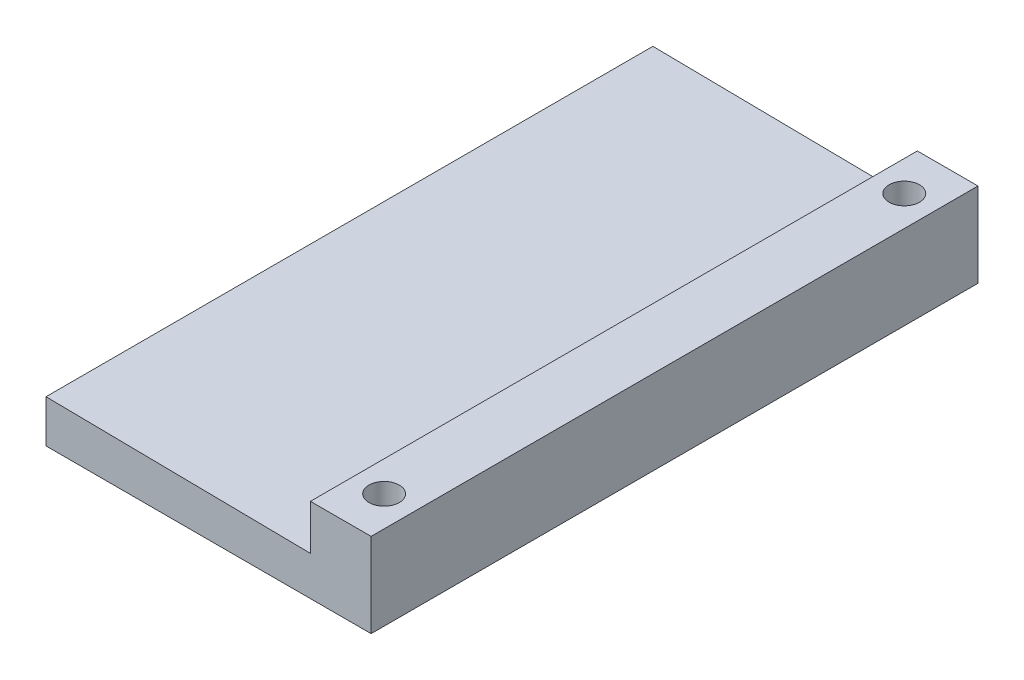
ISO-10303-21;
HEADER;
FILE_DESCRIPTION(('STEP AP214'),'2;1');
FILE_NAME('part.step','',(''),(''),'','','');
FILE_SCHEMA(('AUTOMOTIVE_DESIGN { 1 0 10303 214 1 1 1 1 }'));
ENDSEC;
DATA;
#1=APPLICATION_CONTEXT('core data for automotive mechanical design processes');
#2=APPLICATION_PROTOCOL_DEFINITION('international standard','automotive_design',2000,#1);
#3=PRODUCT_CONTEXT('',#1,'mechanical');
#4=PRODUCT('Part','Part','',(#3));
#5=PRODUCT_RELATED_PRODUCT_CATEGORY('part','',(#4));
#6=PRODUCT_DEFINITION_FORMATION('','',#4);
#7=PRODUCT_DEFINITION_CONTEXT('part definition',#1,'design');
#8=PRODUCT_DEFINITION('design','',#6,#7);
#9=PRODUCT_DEFINITION_SHAPE('','',#8);
#10=(LENGTH_UNIT() NAMED_UNIT(*) SI_UNIT(.MILLI.,.METRE.));
#11=(NAMED_UNIT(*) PLANE_ANGLE_UNIT() SI_UNIT($,.RADIAN.));
#12=(NAMED_UNIT(*) SI_UNIT($,.STERADIAN.) SOLID_ANGLE_UNIT());
#13=UNCERTAINTY_MEASURE_WITH_UNIT(LENGTH_MEASURE(1.E-05),#10,'distance_accuracy_value','');
#14=(GEOMETRIC_REPRESENTATION_CONTEXT(3) GLOBAL_UNCERTAINTY_ASSIGNED_CONTEXT((#13)) GLOBAL_UNIT_ASSIGNED_CONTEXT((#10,
#11,#12)) REPRESENTATION_CONTEXT('',''));
#15=CARTESIAN_POINT('',(0.,0.,0.));
#16=DIRECTION('',(0.,0.,1.));
#17=DIRECTION('',(1.,0.,0.));
#18=AXIS2_PLACEMENT_3D('',#15,#16,#17);
#19=CARTESIAN_POINT('',(45.72,0.,-82.55));
#20=DIRECTION('',(0.,1.,0.));
#21=DIRECTION('',(0.,0.,1.));
#22=AXIS2_PLACEMENT_3D('',#19,#20,#21);
#23=CYLINDRICAL_SURFACE('',#22,2.2225);
#24=CARTESIAN_POINT('',(45.72,12.3444,-82.55));
#25=DIRECTION('',(0.,1.,0.));
#26=DIRECTION('',(0.,0.,1.));
#27=AXIS2_PLACEMENT_3D('',#24,#25,#26);
#28=CIRCLE('',#27,2.2225);
#29=CARTESIAN_POINT('',(45.72,12.3444,-80.3275));
#30=VERTEX_POINT('',#29);
#31=EDGE_CURVE('E154',#30,#30,#28,.T.);
#32=ORIENTED_EDGE('',*,*,#31,.T.);
#33=EDGE_LOOP('',(#32));
#34=FACE_BOUND('',#33,.T.);
#35=CARTESIAN_POINT('',(45.72,4.064,-82.55));
#36=DIRECTION('',(0.,-1.,0.));
#37=DIRECTION('',(0.,0.,-1.));
#38=AXIS2_PLACEMENT_3D('',#35,#36,#37);
#39=CIRCLE('',#38,2.2225);
#40=CARTESIAN_POINT('',(45.72,4.064,-84.7725));
#41=VERTEX_POINT('',#40);
#42=EDGE_CURVE('E49',#41,#41,#39,.F.);
#43=ORIENTED_EDGE('',*,*,#42,.F.);
#44=EDGE_LOOP('',(#43));
#45=FACE_BOUND('',#44,.T.);
#46=ADVANCED_FACE('F45',(#34,#45),#23,.F.);
#47=CARTESIAN_POINT('',(45.72,0.,-6.34999999999999));
#48=DIRECTION('',(0.,1.,0.));
#49=DIRECTION('',(0.,0.,1.));
#50=AXIS2_PLACEMENT_3D('',#47,#48,#49);
#51=CYLINDRICAL_SURFACE('',#50,2.2225);
#52=CARTESIAN_POINT('',(45.72,12.3444,-6.34999999999999));
#53=DIRECTION('',(0.,1.,0.));
#54=DIRECTION('',(0.,0.,1.));
#55=AXIS2_PLACEMENT_3D('',#52,#53,#54);
#56=CIRCLE('',#55,2.2225);
#57=CARTESIAN_POINT('',(45.72,12.3444,-4.12749999999999));
#58=VERTEX_POINT('',#57);
#59=EDGE_CURVE('E150',#58,#58,#56,.T.);
#60=ORIENTED_EDGE('',*,*,#59,.T.);
#61=EDGE_LOOP('',(#60));
#62=FACE_BOUND('',#61,.T.);
#63=CARTESIAN_POINT('',(45.72,4.064,-6.34999999999999));
#64=DIRECTION('',(0.,-1.,0.));
#65=DIRECTION('',(0.,0.,-1.));
#66=AXIS2_PLACEMENT_3D('',#63,#64,#65);
#67=CIRCLE('',#66,2.2225);
#68=CARTESIAN_POINT('',(45.72,4.064,-8.5725));
#69=VERTEX_POINT('',#68);
#70=EDGE_CURVE('E141',#69,#69,#67,.F.);
#71=ORIENTED_EDGE('',*,*,#70,.F.);
#72=EDGE_LOOP('',(#71));
#73=FACE_BOUND('',#72,.T.);
#74=ADVANCED_FACE('F179',(#62,#73),#51,.F.);
#75=CARTESIAN_POINT('',(0.,5.9944,0.));
#76=DIRECTION('',(0.,0.,-1.));
#77=DIRECTION('',(-1.,0.,0.));
#78=AXIS2_PLACEMENT_3D('',#75,#76,#77);
#79=PLANE('',#78);
#80=DIRECTION('',(0.,-1.,0.));
#81=VECTOR('',#80,1.);
#82=CARTESIAN_POINT('',(41.275,12.3444,0.));
#83=LINE('',#82,#81);
#84=CARTESIAN_POINT('',(41.275,12.3444,0.));
#85=VERTEX_POINT('',#84);
#86=CARTESIAN_POINT('',(41.275,5.7404,0.));
#87=VERTEX_POINT('',#86);
#88=EDGE_CURVE('E108',#85,#87,#83,.T.);
#89=ORIENTED_EDGE('',*,*,#88,.T.);
#90=DIRECTION('',(0.999914012704464,-0.0131136263961241,0.));
#91=VECTOR('',#90,1.);
#92=CARTESIAN_POINT('',(0.0823689341258155,6.28063122709343,0.));
#93=LINE('',#92,#91);
#94=CARTESIAN_POINT('',(2.54000000000001,6.2484,0.));
#95=VERTEX_POINT('',#94);
#96=EDGE_CURVE('E110',#95,#87,#93,.T.);
#97=ORIENTED_EDGE('',*,*,#96,.F.);
#98=DIRECTION('',(0.,1.,0.));
#99=VECTOR('',#98,1.);
#100=CARTESIAN_POINT('',(2.54000000000001,0.,0.));
#101=LINE('',#100,#99);
#102=CARTESIAN_POINT('',(2.54000000000001,0.,0.));
#103=VERTEX_POINT('',#102);
#104=EDGE_CURVE('E134',#103,#95,#101,.T.);
#105=ORIENTED_EDGE('',*,*,#104,.F.);
#106=DIRECTION('',(1.,0.,0.));
#107=VECTOR('',#106,1.);
#108=CARTESIAN_POINT('',(0.,0.,0.));
#109=LINE('',#108,#107);
#110=CARTESIAN_POINT('',(50.165,0.,0.));
#111=VERTEX_POINT('',#110);
#112=EDGE_CURVE('E54',#103,#111,#109,.T.);
#113=ORIENTED_EDGE('',*,*,#112,.T.);
#114=DIRECTION('',(0.,-1.,0.));
#115=VECTOR('',#114,1.);
#116=CARTESIAN_POINT('',(50.165,12.3444,0.));
#117=LINE('',#116,#115);
#118=CARTESIAN_POINT('',(50.165,12.3444,0.));
#119=VERTEX_POINT('',#118);
#120=EDGE_CURVE('E115',#119,#111,#117,.T.);
#121=ORIENTED_EDGE('',*,*,#120,.F.);
#122=DIRECTION('',(1.,0.,0.));
#123=VECTOR('',#122,1.);
#124=CARTESIAN_POINT('',(0.,12.3444,0.));
#125=LINE('',#124,#123);
#126=EDGE_CURVE('E71',#85,#119,#125,.T.);
#127=ORIENTED_EDGE('',*,*,#126,.F.);
#128=EDGE_LOOP('',(#89,#97,#105,#113,#121,#127));
#129=FACE_BOUND('',#128,.T.);
#130=ADVANCED_FACE('F47',(#129),#79,.F.);
#131=CARTESIAN_POINT('',(0.,5.9944,-88.9));
#132=DIRECTION('',(0.,0.,-1.));
#133=DIRECTION('',(-1.,0.,0.));
#134=AXIS2_PLACEMENT_3D('',#131,#132,#133);
#135=PLANE('',#134);
#136=DIRECTION('',(0.999914012704464,-0.0131136263961241,0.));
#137=VECTOR('',#136,1.);
#138=CARTESIAN_POINT('',(0.0823689341258155,6.28063122709343,-88.9));
#139=LINE('',#138,#137);
#140=CARTESIAN_POINT('',(2.54000000000001,6.2484,-88.9));
#141=VERTEX_POINT('',#140);
#142=CARTESIAN_POINT('',(41.275,5.7404,-88.9));
#143=VERTEX_POINT('',#142);
#144=EDGE_CURVE('E124',#141,#143,#139,.T.);
#145=ORIENTED_EDGE('',*,*,#144,.T.);
#146=DIRECTION('',(0.,-1.,0.));
#147=VECTOR('',#146,1.);
#148=CARTESIAN_POINT('',(41.275,12.3444,-88.9));
#149=LINE('',#148,#147);
#150=CARTESIAN_POINT('',(41.275,12.3444,-88.9));
#151=VERTEX_POINT('',#150);
#152=EDGE_CURVE('E114',#151,#143,#149,.T.);
#153=ORIENTED_EDGE('',*,*,#152,.F.);
#154=DIRECTION('',(1.,0.,0.));
#155=VECTOR('',#154,1.);
#156=CARTESIAN_POINT('',(0.,12.3444,-88.9));
#157=LINE('',#156,#155);
#158=CARTESIAN_POINT('',(50.165,12.3444,-88.9));
#159=VERTEX_POINT('',#158);
#160=EDGE_CURVE('E159',#151,#159,#157,.T.);
#161=ORIENTED_EDGE('',*,*,#160,.T.);
#162=DIRECTION('',(0.,-1.,0.));
#163=VECTOR('',#162,1.);
#164=CARTESIAN_POINT('',(50.165,12.3444,-88.9));
#165=LINE('',#164,#163);
#166=CARTESIAN_POINT('',(50.165,0.,-88.9));
#167=VERTEX_POINT('',#166);
#168=EDGE_CURVE('E93',#159,#167,#165,.T.);
#169=ORIENTED_EDGE('',*,*,#168,.T.);
#170=DIRECTION('',(1.,0.,0.));
#171=VECTOR('',#170,1.);
#172=CARTESIAN_POINT('',(0.,0.,-88.9));
#173=LINE('',#172,#171);
#174=CARTESIAN_POINT('',(2.54,0.,-88.9));
#175=VERTEX_POINT('',#174);
#176=EDGE_CURVE('E11',#175,#167,#173,.T.);
#177=ORIENTED_EDGE('',*,*,#176,.F.);
#178=DIRECTION('',(0.,1.,0.));
#179=VECTOR('',#178,1.);
#180=CARTESIAN_POINT('',(2.54,0.,-88.9));
#181=LINE('',#180,#179);
#182=EDGE_CURVE('E62',#175,#141,#181,.T.);
#183=ORIENTED_EDGE('',*,*,#182,.T.);
#184=EDGE_LOOP('',(#145,#153,#161,#169,#177,#183));
#185=FACE_BOUND('',#184,.T.);
#186=ADVANCED_FACE('F202',(#185),#135,.T.);
#187=CARTESIAN_POINT('',(0.,0.,0.));
#188=DIRECTION('',(0.,1.,0.));
#189=DIRECTION('',(0.,0.,1.));
#190=AXIS2_PLACEMENT_3D('',#187,#188,#189);
#191=PLANE('',#190);
#192=CARTESIAN_POINT('',(45.72,0.,-6.34999999999999));
#193=DIRECTION('',(0.,-1.,0.));
#194=DIRECTION('',(0.,0.,-1.));
#195=AXIS2_PLACEMENT_3D('',#192,#193,#194);
#196=CIRCLE('',#195,3.683);
#197=CARTESIAN_POINT('',(45.72,0.,-10.033));
#198=VERTEX_POINT('',#197);
#199=EDGE_CURVE('E142',#198,#198,#196,.T.);
#200=ORIENTED_EDGE('',*,*,#199,.F.);
#201=EDGE_LOOP('',(#200));
#202=FACE_BOUND('',#201,.T.);
#203=CARTESIAN_POINT('',(45.72,0.,-82.55));
#204=DIRECTION('',(0.,-1.,0.));
#205=DIRECTION('',(0.,0.,-1.));
#206=AXIS2_PLACEMENT_3D('',#203,#204,#205);
#207=CIRCLE('',#206,3.683);
#208=CARTESIAN_POINT('',(45.72,0.,-86.233));
#209=VERTEX_POINT('',#208);
#210=EDGE_CURVE('E145',#209,#209,#207,.T.);
#211=ORIENTED_EDGE('',*,*,#210,.F.);
#212=EDGE_LOOP('',(#211));
#213=FACE_BOUND('',#212,.T.);
#214=ORIENTED_EDGE('',*,*,#112,.F.);
#215=DIRECTION('',(0.,0.,-1.));
#216=VECTOR('',#215,1.);
#217=CARTESIAN_POINT('',(2.54,0.,-88.9));
#218=LINE('',#217,#216);
#219=EDGE_CURVE('E131',#103,#175,#218,.T.);
#220=ORIENTED_EDGE('',*,*,#219,.T.);
#221=ORIENTED_EDGE('',*,*,#176,.T.);
#222=DIRECTION('',(0.,0.,1.));
#223=VECTOR('',#222,1.);
#224=CARTESIAN_POINT('',(50.165,0.,0.));
#225=LINE('',#224,#223);
#226=EDGE_CURVE('E153',#167,#111,#225,.T.);
#227=ORIENTED_EDGE('',*,*,#226,.T.);
#228=EDGE_LOOP('',(#214,#220,#221,#227));
#229=FACE_BOUND('',#228,.T.);
#230=ADVANCED_FACE('F198',(#202,#213,#229),#191,.F.);
#231=CARTESIAN_POINT('',(41.275,12.3444,0.));
#232=DIRECTION('',(-1.,0.,0.));
#233=DIRECTION('',(0.,0.,1.));
#234=AXIS2_PLACEMENT_3D('',#231,#232,#233);
#235=PLANE('',#234);
#236=ORIENTED_EDGE('',*,*,#152,.T.);
#237=DIRECTION('',(0.,0.,1.));
#238=VECTOR('',#237,1.);
#239=CARTESIAN_POINT('',(41.275,5.7404,-108.269165502158));
#240=LINE('',#239,#238);
#241=EDGE_CURVE('E122',#143,#87,#240,.T.);
#242=ORIENTED_EDGE('',*,*,#241,.T.);
#243=ORIENTED_EDGE('',*,*,#88,.F.);
#244=DIRECTION('',(0.,0.,-1.));
#245=VECTOR('',#244,1.);
#246=CARTESIAN_POINT('',(41.275,12.3444,0.));
#247=LINE('',#246,#245);
#248=EDGE_CURVE('E162',#85,#151,#247,.T.);
#249=ORIENTED_EDGE('',*,*,#248,.T.);
#250=EDGE_LOOP('',(#236,#242,#243,#249));
#251=FACE_BOUND('',#250,.T.);
#252=ADVANCED_FACE('F126',(#251),#235,.T.);
#253=CARTESIAN_POINT('',(50.165,12.3444,0.));
#254=DIRECTION('',(1.,0.,0.));
#255=DIRECTION('',(0.,0.,-1.));
#256=AXIS2_PLACEMENT_3D('',#253,#254,#255);
#257=PLANE('',#256);
#258=ORIENTED_EDGE('',*,*,#226,.F.);
#259=ORIENTED_EDGE('',*,*,#168,.F.);
#260=DIRECTION('',(0.,0.,1.));
#261=VECTOR('',#260,1.);
#262=CARTESIAN_POINT('',(50.165,12.3444,0.));
#263=LINE('',#262,#261);
#264=EDGE_CURVE('E157',#159,#119,#263,.T.);
#265=ORIENTED_EDGE('',*,*,#264,.T.);
#266=ORIENTED_EDGE('',*,*,#120,.T.);
#267=EDGE_LOOP('',(#258,#259,#265,#266));
#268=FACE_BOUND('',#267,.T.);
#269=ADVANCED_FACE('F194',(#268),#257,.T.);
#270=CARTESIAN_POINT('',(0.,12.3444,0.));
#271=DIRECTION('',(0.,1.,0.));
#272=DIRECTION('',(0.,0.,1.));
#273=AXIS2_PLACEMENT_3D('',#270,#271,#272);
#274=PLANE('',#273);
#275=ORIENTED_EDGE('',*,*,#59,.F.);
#276=EDGE_LOOP('',(#275));
#277=FACE_BOUND('',#276,.T.);
#278=ORIENTED_EDGE('',*,*,#31,.F.);
#279=EDGE_LOOP('',(#278));
#280=FACE_BOUND('',#279,.T.);
#281=ORIENTED_EDGE('',*,*,#264,.F.);
#282=ORIENTED_EDGE('',*,*,#160,.F.);
#283=ORIENTED_EDGE('',*,*,#248,.F.);
#284=ORIENTED_EDGE('',*,*,#126,.T.);
#285=EDGE_LOOP('',(#281,#282,#283,#284));
#286=FACE_BOUND('',#285,.T.);
#287=ADVANCED_FACE('F190',(#277,#280,#286),#274,.T.);
#288=CARTESIAN_POINT('',(45.72,4.064,-6.34999999999999));
#289=DIRECTION('',(0.,-1.,0.));
#290=DIRECTION('',(0.,0.,-1.));
#291=AXIS2_PLACEMENT_3D('',#288,#289,#290);
#292=PLANE('',#291);
#293=CARTESIAN_POINT('',(45.72,4.064,-6.34999999999999));
#294=DIRECTION('',(0.,-1.,0.));
#295=DIRECTION('',(0.,0.,-1.));
#296=AXIS2_PLACEMENT_3D('',#293,#294,#295);
#297=CIRCLE('',#296,3.683);
#298=CARTESIAN_POINT('',(45.72,4.064,-10.033));
#299=VERTEX_POINT('',#298);
#300=EDGE_CURVE('E138',#299,#299,#297,.T.);
#301=ORIENTED_EDGE('',*,*,#300,.T.);
#302=EDGE_LOOP('',(#301));
#303=FACE_BOUND('',#302,.T.);
#304=ORIENTED_EDGE('',*,*,#70,.T.);
#305=EDGE_LOOP('',(#304));
#306=FACE_BOUND('',#305,.T.);
#307=ADVANCED_FACE('F193',(#303,#306),#292,.T.);
#308=CARTESIAN_POINT('',(45.72,4.064,-6.34999999999999));
#309=DIRECTION('',(0.,-1.,0.));
#310=DIRECTION('',(0.,0.,-1.));
#311=AXIS2_PLACEMENT_3D('',#308,#309,#310);
#312=CYLINDRICAL_SURFACE('',#311,3.683);
#313=ORIENTED_EDGE('',*,*,#300,.F.);
#314=EDGE_LOOP('',(#313));
#315=FACE_BOUND('',#314,.T.);
#316=ORIENTED_EDGE('',*,*,#199,.T.);
#317=EDGE_LOOP('',(#316));
#318=FACE_BOUND('',#317,.T.);
#319=ADVANCED_FACE('F226',(#315,#318),#312,.F.);
#320=CARTESIAN_POINT('',(45.72,4.064,-82.55));
#321=DIRECTION('',(0.,-1.,0.));
#322=DIRECTION('',(0.,0.,-1.));
#323=AXIS2_PLACEMENT_3D('',#320,#321,#322);
#324=PLANE('',#323);
#325=CARTESIAN_POINT('',(45.72,4.064,-82.55));
#326=DIRECTION('',(0.,-1.,0.));
#327=DIRECTION('',(0.,0.,-1.));
#328=AXIS2_PLACEMENT_3D('',#325,#326,#327);
#329=CIRCLE('',#328,3.683);
#330=CARTESIAN_POINT('',(45.72,4.064,-86.233));
#331=VERTEX_POINT('',#330);
#332=EDGE_CURVE('E136',#331,#331,#329,.T.);
#333=ORIENTED_EDGE('',*,*,#332,.T.);
#334=EDGE_LOOP('',(#333));
#335=FACE_BOUND('',#334,.T.);
#336=ORIENTED_EDGE('',*,*,#42,.T.);
#337=EDGE_LOOP('',(#336));
#338=FACE_BOUND('',#337,.T.);
#339=ADVANCED_FACE('F176',(#335,#338),#324,.T.);
#340=CARTESIAN_POINT('',(45.72,4.064,-82.55));
#341=DIRECTION('',(0.,-1.,0.));
#342=DIRECTION('',(0.,0.,-1.));
#343=AXIS2_PLACEMENT_3D('',#340,#341,#342);
#344=CYLINDRICAL_SURFACE('',#343,3.683);
#345=ORIENTED_EDGE('',*,*,#332,.F.);
#346=EDGE_LOOP('',(#345));
#347=FACE_BOUND('',#346,.T.);
#348=ORIENTED_EDGE('',*,*,#210,.T.);
#349=EDGE_LOOP('',(#348));
#350=FACE_BOUND('',#349,.T.);
#351=ADVANCED_FACE('F214',(#347,#350),#344,.F.);
#352=CARTESIAN_POINT('',(2.54,0.,-88.9));
#353=DIRECTION('',(1.,0.,0.));
#354=DIRECTION('',(0.,0.,-1.));
#355=AXIS2_PLACEMENT_3D('',#352,#353,#354);
#356=PLANE('',#355);
#357=ORIENTED_EDGE('',*,*,#104,.T.);
#358=DIRECTION('',(0.,0.,1.));
#359=VECTOR('',#358,1.);
#360=CARTESIAN_POINT('',(2.54000000000001,6.2484,-108.269165502158));
#361=LINE('',#360,#359);
#362=EDGE_CURVE('E123',#141,#95,#361,.T.);
#363=ORIENTED_EDGE('',*,*,#362,.F.);
#364=ORIENTED_EDGE('',*,*,#182,.F.);
#365=ORIENTED_EDGE('',*,*,#219,.F.);
#366=EDGE_LOOP('',(#357,#363,#364,#365));
#367=FACE_BOUND('',#366,.T.);
#368=ADVANCED_FACE('F211',(#367),#356,.F.);
#369=CARTESIAN_POINT('',(0.0823689341258155,6.28063122709343,-108.269165502158));
#370=DIRECTION('',(-0.0131136263961241,-0.999914012704464,0.));
#371=DIRECTION('',(0.999914012704464,-0.0131136263961241,0.));
#372=AXIS2_PLACEMENT_3D('',#369,#370,#371);
#373=PLANE('',#372);
#374=ORIENTED_EDGE('',*,*,#144,.F.);
#375=ORIENTED_EDGE('',*,*,#362,.T.);
#376=ORIENTED_EDGE('',*,*,#96,.T.);
#377=ORIENTED_EDGE('',*,*,#241,.F.);
#378=EDGE_LOOP('',(#374,#375,#376,#377));
#379=FACE_BOUND('',#378,.T.);
#380=ADVANCED_FACE('F121',(#379),#373,.F.);
#381=CLOSED_SHELL('',(#46,#74,#130,#186,#230,#252,#269,#287,#307,#319,#339,#351,#368,#380));
#382=MANIFOLD_SOLID_BREP('B2',#381);
#383=ADVANCED_BREP_SHAPE_REPRESENTATION('',(#18,#382),#14);
#384=SHAPE_DEFINITION_REPRESENTATION(#9,#383);
ENDSEC;
END-ISO-10303-21;
